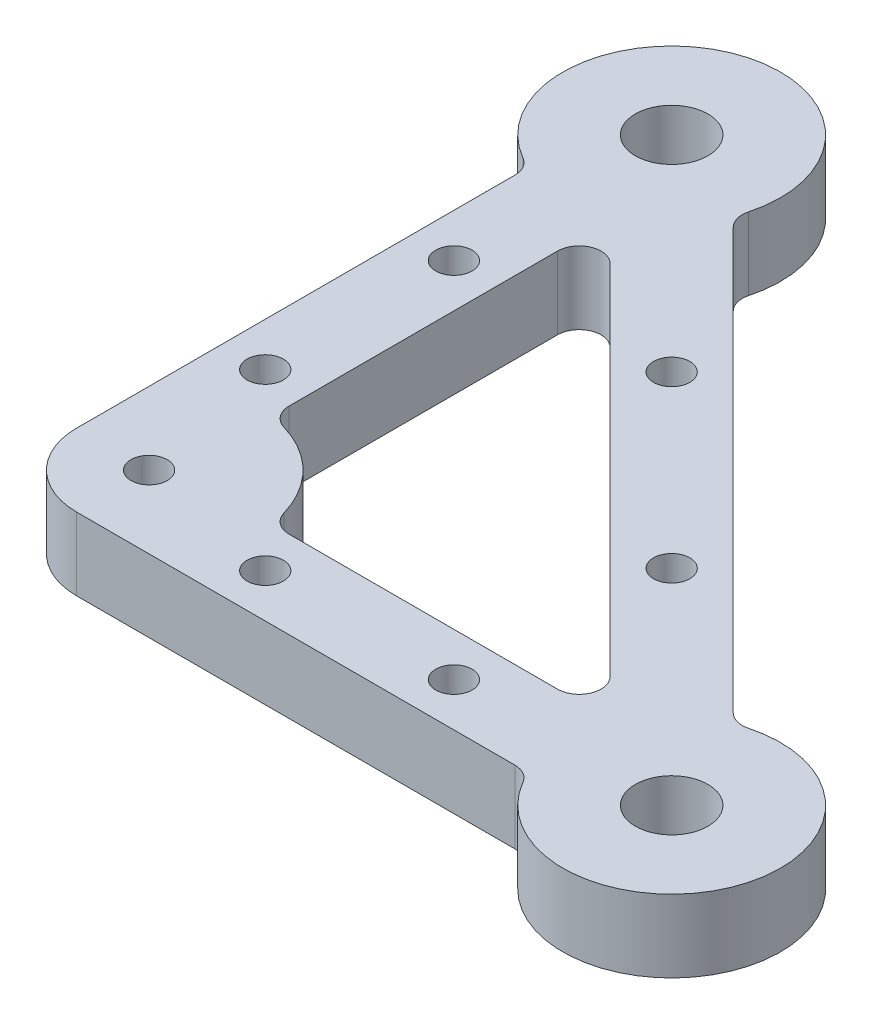
ISO-10303-21;
HEADER;
FILE_DESCRIPTION(('STEP AP214'),'2;1');
FILE_NAME('part.step','',(''),(''),'','','');
FILE_SCHEMA(('AUTOMOTIVE_DESIGN { 1 0 10303 214 1 1 1 1 }'));
ENDSEC;
DATA;
#1=APPLICATION_CONTEXT('core data for automotive mechanical design processes');
#2=APPLICATION_PROTOCOL_DEFINITION('international standard','automotive_design',2000,#1);
#3=PRODUCT_CONTEXT('',#1,'mechanical');
#4=PRODUCT('Part','Part','',(#3));
#5=PRODUCT_RELATED_PRODUCT_CATEGORY('part','',(#4));
#6=PRODUCT_DEFINITION_FORMATION('','',#4);
#7=PRODUCT_DEFINITION_CONTEXT('part definition',#1,'design');
#8=PRODUCT_DEFINITION('design','',#6,#7);
#9=PRODUCT_DEFINITION_SHAPE('','',#8);
#10=(LENGTH_UNIT() NAMED_UNIT(*) SI_UNIT(.MILLI.,.METRE.));
#11=(NAMED_UNIT(*) PLANE_ANGLE_UNIT() SI_UNIT($,.RADIAN.));
#12=(NAMED_UNIT(*) SI_UNIT($,.STERADIAN.) SOLID_ANGLE_UNIT());
#13=UNCERTAINTY_MEASURE_WITH_UNIT(LENGTH_MEASURE(1.E-05),#10,'distance_accuracy_value','');
#14=(GEOMETRIC_REPRESENTATION_CONTEXT(3) GLOBAL_UNCERTAINTY_ASSIGNED_CONTEXT((#13)) GLOBAL_UNIT_ASSIGNED_CONTEXT((#10,
#11,#12)) REPRESENTATION_CONTEXT('',''));
#15=CARTESIAN_POINT('',(0.,0.,0.));
#16=DIRECTION('',(0.,0.,1.));
#17=DIRECTION('',(1.,0.,0.));
#18=AXIS2_PLACEMENT_3D('',#15,#16,#17);
#19=CARTESIAN_POINT('',(0.,10.,0.));
#20=DIRECTION('',(0.,1.,0.));
#21=DIRECTION('',(0.,0.,1.));
#22=AXIS2_PLACEMENT_3D('',#19,#20,#21);
#23=PLANE('',#22);
#24=CARTESIAN_POINT('',(51.7157287525381,10.,51.7157287525381));
#25=DIRECTION('',(0.,1.,0.));
#26=DIRECTION('',(0.,0.,1.));
#27=AXIS2_PLACEMENT_3D('',#24,#25,#26);
#28=CIRCLE('',#27,2.5);
#29=CARTESIAN_POINT('',(51.7157287525381,10.,54.2157287525381));
#30=VERTEX_POINT('',#29);
#31=EDGE_CURVE('E364',#30,#30,#28,.T.);
#32=ORIENTED_EDGE('',*,*,#31,.F.);
#33=EDGE_LOOP('',(#32));
#34=FACE_BOUND('',#33,.T.);
#35=CARTESIAN_POINT('',(0.,10.,30.));
#36=DIRECTION('',(0.,1.,0.));
#37=DIRECTION('',(0.,0.,1.));
#38=AXIS2_PLACEMENT_3D('',#35,#36,#37);
#39=CIRCLE('',#38,2.5);
#40=CARTESIAN_POINT('',(0.,10.,32.5));
#41=VERTEX_POINT('',#40);
#42=EDGE_CURVE('E380',#41,#41,#39,.T.);
#43=ORIENTED_EDGE('',*,*,#42,.F.);
#44=EDGE_LOOP('',(#43));
#45=FACE_BOUND('',#44,.T.);
#46=CARTESIAN_POINT('',(24.,10.,80.));
#47=DIRECTION('',(0.,1.,0.));
#48=DIRECTION('',(0.,0.,1.));
#49=AXIS2_PLACEMENT_3D('',#46,#47,#48);
#50=CIRCLE('',#49,2.5);
#51=CARTESIAN_POINT('',(24.,10.,82.5));
#52=VERTEX_POINT('',#51);
#53=EDGE_CURVE('E396',#52,#52,#50,.T.);
#54=ORIENTED_EDGE('',*,*,#53,.F.);
#55=EDGE_LOOP('',(#54));
#56=FACE_BOUND('',#55,.T.);
#57=CARTESIAN_POINT('',(80.,10.,80.));
#58=DIRECTION('',(0.,1.,0.));
#59=DIRECTION('',(0.,0.,1.));
#60=AXIS2_PLACEMENT_3D('',#57,#58,#59);
#61=CIRCLE('',#60,5.00000000000001);
#62=CARTESIAN_POINT('',(80.,10.,85.));
#63=VERTEX_POINT('',#62);
#64=EDGE_CURVE('E412',#63,#63,#61,.T.);
#65=ORIENTED_EDGE('',*,*,#64,.F.);
#66=EDGE_LOOP('',(#65));
#67=FACE_BOUND('',#66,.T.);
#68=CARTESIAN_POINT('',(0.,10.,0.));
#69=DIRECTION('',(0.,1.,0.));
#70=DIRECTION('',(0.,0.,1.));
#71=AXIS2_PLACEMENT_3D('',#68,#69,#70);
#72=CIRCLE('',#71,15.);
#73=CARTESIAN_POINT('',(14.488887394336,10.,3.88228567653781));
#74=VERTEX_POINT('',#73);
#75=CARTESIAN_POINT('',(-7.5,10.,12.9903810567666));
#76=VERTEX_POINT('',#75);
#77=EDGE_CURVE('E187',#74,#76,#72,.T.);
#78=ORIENTED_EDGE('',*,*,#77,.T.);
#79=CARTESIAN_POINT('',(-9.,10.,15.5884572681199));
#80=DIRECTION('',(0.,1.,0.));
#81=DIRECTION('',(0.,0.,1.));
#82=AXIS2_PLACEMENT_3D('',#79,#80,#81);
#83=CIRCLE('',#82,3.);
#84=CARTESIAN_POINT('',(-6.,10.,15.5884572681199));
#85=VERTEX_POINT('',#84);
#86=EDGE_CURVE('E262',#76,#85,#83,.F.);
#87=ORIENTED_EDGE('',*,*,#86,.T.);
#88=DIRECTION('',(0.,0.,1.));
#89=VECTOR('',#88,1.);
#90=CARTESIAN_POINT('',(-6.,10.,86.));
#91=LINE('',#90,#89);
#92=CARTESIAN_POINT('',(-6.,10.,76.));
#93=VERTEX_POINT('',#92);
#94=EDGE_CURVE('E212',#85,#93,#91,.T.);
#95=ORIENTED_EDGE('',*,*,#94,.T.);
#96=CARTESIAN_POINT('',(4.,10.,76.));
#97=DIRECTION('',(0.,1.,0.));
#98=DIRECTION('',(0.,0.,1.));
#99=AXIS2_PLACEMENT_3D('',#96,#97,#98);
#100=CIRCLE('',#99,10.);
#101=CARTESIAN_POINT('',(4.,10.,86.));
#102=VERTEX_POINT('',#101);
#103=EDGE_CURVE('E216',#93,#102,#100,.T.);
#104=ORIENTED_EDGE('',*,*,#103,.T.);
#105=DIRECTION('',(1.,0.,0.));
#106=VECTOR('',#105,1.);
#107=CARTESIAN_POINT('',(66.2522729151325,10.,86.));
#108=LINE('',#107,#106);
#109=CARTESIAN_POINT('',(64.4115427318801,10.,86.));
#110=VERTEX_POINT('',#109);
#111=EDGE_CURVE('E185',#102,#110,#108,.T.);
#112=ORIENTED_EDGE('',*,*,#111,.T.);
#113=CARTESIAN_POINT('',(64.4115427318801,10.,89.));
#114=DIRECTION('',(0.,1.,0.));
#115=DIRECTION('',(0.,0.,1.));
#116=AXIS2_PLACEMENT_3D('',#113,#114,#115);
#117=CIRCLE('',#116,3.);
#118=CARTESIAN_POINT('',(67.0096189432334,10.,87.5));
#119=VERTEX_POINT('',#118);
#120=EDGE_CURVE('E267',#110,#119,#117,.F.);
#121=ORIENTED_EDGE('',*,*,#120,.T.);
#122=CARTESIAN_POINT('',(80.,10.,80.));
#123=DIRECTION('',(0.,1.,0.));
#124=DIRECTION('',(0.,0.,1.));
#125=AXIS2_PLACEMENT_3D('',#122,#123,#124);
#126=CIRCLE('',#125,15.);
#127=CARTESIAN_POINT('',(76.1177143234622,10.,65.511112605664));
#128=VERTEX_POINT('',#127);
#129=EDGE_CURVE('E430',#119,#128,#126,.T.);
#130=ORIENTED_EDGE('',*,*,#129,.T.);
#131=CARTESIAN_POINT('',(75.3412571881546,10.,62.6133351267968));
#132=DIRECTION('',(0.,1.,0.));
#133=DIRECTION('',(0.,0.,1.));
#134=AXIS2_PLACEMENT_3D('',#131,#132,#133);
#135=CIRCLE('',#134,3.);
#136=CARTESIAN_POINT('',(73.219936844595,10.,64.7346554703564));
#137=VERTEX_POINT('',#136);
#138=EDGE_CURVE('E250',#128,#137,#135,.F.);
#139=ORIENTED_EDGE('',*,*,#138,.T.);
#140=DIRECTION('',(-0.707106781186547,0.,-0.707106781186548));
#141=VECTOR('',#140,1.);
#142=CARTESIAN_POINT('',(13.9637517347311,10.,5.4784703604925));
#143=LINE('',#142,#141);
#144=CARTESIAN_POINT('',(15.2653445296436,10.,6.78006315540501));
#145=VERTEX_POINT('',#144);
#146=EDGE_CURVE('E434',#137,#145,#143,.T.);
#147=ORIENTED_EDGE('',*,*,#146,.T.);
#148=CARTESIAN_POINT('',(17.3866648732032,10.,4.65874281184537));
#149=DIRECTION('',(0.,1.,0.));
#150=DIRECTION('',(0.,0.,1.));
#151=AXIS2_PLACEMENT_3D('',#148,#149,#150);
#152=CIRCLE('',#151,3.);
#153=EDGE_CURVE('E256',#145,#74,#152,.F.);
#154=ORIENTED_EDGE('',*,*,#153,.T.);
#155=EDGE_LOOP('',(#78,#87,#95,#104,#112,#121,#130,#139,#147,#154));
#156=FACE_BOUND('',#155,.T.);
#157=CARTESIAN_POINT('',(0.,10.,0.));
#158=DIRECTION('',(0.,1.,0.));
#159=DIRECTION('',(0.,0.,1.));
#160=AXIS2_PLACEMENT_3D('',#157,#158,#159);
#161=CIRCLE('',#160,5.);
#162=CARTESIAN_POINT('',(0.,10.,5.));
#163=VERTEX_POINT('',#162);
#164=EDGE_CURVE('E202',#163,#163,#161,.T.);
#165=ORIENTED_EDGE('',*,*,#164,.F.);
#166=EDGE_LOOP('',(#165));
#167=FACE_BOUND('',#166,.T.);
#168=CARTESIAN_POINT('',(50.,10.,80.));
#169=DIRECTION('',(0.,1.,0.));
#170=DIRECTION('',(0.,0.,1.));
#171=AXIS2_PLACEMENT_3D('',#168,#169,#170);
#172=CIRCLE('',#171,2.5);
#173=CARTESIAN_POINT('',(50.,10.,82.5));
#174=VERTEX_POINT('',#173);
#175=EDGE_CURVE('E404',#174,#174,#172,.T.);
#176=ORIENTED_EDGE('',*,*,#175,.F.);
#177=EDGE_LOOP('',(#176));
#178=FACE_BOUND('',#177,.T.);
#179=CARTESIAN_POINT('',(0.,10.,56.));
#180=DIRECTION('',(0.,1.,0.));
#181=DIRECTION('',(0.,0.,1.));
#182=AXIS2_PLACEMENT_3D('',#179,#180,#181);
#183=CIRCLE('',#182,2.5);
#184=CARTESIAN_POINT('',(0.,10.,58.5));
#185=VERTEX_POINT('',#184);
#186=EDGE_CURVE('E388',#185,#185,#183,.T.);
#187=ORIENTED_EDGE('',*,*,#186,.F.);
#188=EDGE_LOOP('',(#187));
#189=FACE_BOUND('',#188,.T.);
#190=CARTESIAN_POINT('',(28.2842712474619,10.,28.2842712474619));
#191=DIRECTION('',(0.,1.,0.));
#192=DIRECTION('',(0.,0.,1.));
#193=AXIS2_PLACEMENT_3D('',#190,#191,#192);
#194=CIRCLE('',#193,2.5);
#195=CARTESIAN_POINT('',(28.2842712474619,10.,30.7842712474619));
#196=VERTEX_POINT('',#195);
#197=EDGE_CURVE('E372',#196,#196,#194,.T.);
#198=ORIENTED_EDGE('',*,*,#197,.F.);
#199=EDGE_LOOP('',(#198));
#200=FACE_BOUND('',#199,.T.);
#201=CARTESIAN_POINT('',(4.,10.,76.));
#202=DIRECTION('',(0.,1.,0.));
#203=DIRECTION('',(0.,0.,1.));
#204=AXIS2_PLACEMENT_3D('',#201,#202,#203);
#205=CIRCLE('',#204,2.5);
#206=CARTESIAN_POINT('',(4.,10.,78.5));
#207=VERTEX_POINT('',#206);
#208=EDGE_CURVE('E356',#207,#207,#205,.T.);
#209=ORIENTED_EDGE('',*,*,#208,.F.);
#210=EDGE_LOOP('',(#209));
#211=FACE_BOUND('',#210,.T.);
#212=DIRECTION('',(0.,0.,1.));
#213=VECTOR('',#212,1.);
#214=CARTESIAN_POINT('',(6.00000000000001,10.,61.1339312526815));
#215=LINE('',#214,#213);
#216=CARTESIAN_POINT('',(6.00000000000001,10.,21.7279220613579));
#217=VERTEX_POINT('',#216);
#218=CARTESIAN_POINT('',(6.00000000000001,10.,58.7083835342094));
#219=VERTEX_POINT('',#218);
#220=EDGE_CURVE('E332',#217,#219,#215,.T.);
#221=ORIENTED_EDGE('',*,*,#220,.F.);
#222=CARTESIAN_POINT('',(9.00000000000001,10.,21.7279220613579));
#223=DIRECTION('',(0.,1.,0.));
#224=DIRECTION('',(0.,0.,1.));
#225=AXIS2_PLACEMENT_3D('',#222,#223,#224);
#226=CIRCLE('',#225,3.);
#227=CARTESIAN_POINT('',(11.1213203435597,10.,19.6066017177982));
#228=VERTEX_POINT('',#227);
#229=EDGE_CURVE('E294',#217,#228,#226,.F.);
#230=ORIENTED_EDGE('',*,*,#229,.T.);
#231=DIRECTION('',(-0.707106781186548,0.,-0.707106781186547));
#232=VECTOR('',#231,1.);
#233=CARTESIAN_POINT('',(6.00000000000001,10.,14.4852813742386));
#234=LINE('',#233,#232);
#235=CARTESIAN_POINT('',(60.3933982822018,10.,68.8786796564403));
#236=VERTEX_POINT('',#235);
#237=EDGE_CURVE('E336',#236,#228,#234,.T.);
#238=ORIENTED_EDGE('',*,*,#237,.F.);
#239=CARTESIAN_POINT('',(58.2720779386421,10.,71.));
#240=DIRECTION('',(0.,1.,0.));
#241=DIRECTION('',(0.,0.,1.));
#242=AXIS2_PLACEMENT_3D('',#239,#240,#241);
#243=CIRCLE('',#242,3.);
#244=CARTESIAN_POINT('',(58.2720779386421,10.,74.));
#245=VERTEX_POINT('',#244);
#246=EDGE_CURVE('E287',#236,#245,#243,.F.);
#247=ORIENTED_EDGE('',*,*,#246,.T.);
#248=DIRECTION('',(1.,0.,0.));
#249=VECTOR('',#248,1.);
#250=CARTESIAN_POINT('',(65.5147186257614,10.,74.));
#251=LINE('',#250,#249);
#252=CARTESIAN_POINT('',(21.2916164657906,10.,74.));
#253=VERTEX_POINT('',#252);
#254=EDGE_CURVE('E340',#253,#245,#251,.T.);
#255=ORIENTED_EDGE('',*,*,#254,.F.);
#256=CARTESIAN_POINT('',(21.2916164657906,10.,71.));
#257=DIRECTION('',(0.,1.,0.));
#258=DIRECTION('',(0.,0.,1.));
#259=AXIS2_PLACEMENT_3D('',#256,#257,#258);
#260=CIRCLE('',#259,3.);
#261=CARTESIAN_POINT('',(18.4096803881588,10.,71.8333333333333));
#262=VERTEX_POINT('',#261);
#263=EDGE_CURVE('E313',#253,#262,#260,.F.);
#264=ORIENTED_EDGE('',*,*,#263,.T.);
#265=CARTESIAN_POINT('',(4.,10.,76.));
#266=DIRECTION('',(0.,-1.,0.));
#267=DIRECTION('',(0.,0.,1.));
#268=AXIS2_PLACEMENT_3D('',#265,#266,#267);
#269=CIRCLE('',#268,15.);
#270=CARTESIAN_POINT('',(8.16666666666667,10.,61.5903196118412));
#271=VERTEX_POINT('',#270);
#272=EDGE_CURVE('E335',#271,#262,#269,.T.);
#273=ORIENTED_EDGE('',*,*,#272,.F.);
#274=CARTESIAN_POINT('',(9.00000000000001,10.,58.7083835342094));
#275=DIRECTION('',(0.,1.,0.));
#276=DIRECTION('',(0.,0.,1.));
#277=AXIS2_PLACEMENT_3D('',#274,#275,#276);
#278=CIRCLE('',#277,3.);
#279=EDGE_CURVE('E11',#271,#219,#278,.F.);
#280=ORIENTED_EDGE('',*,*,#279,.T.);
#281=EDGE_LOOP('',(#221,#230,#238,#247,#255,#264,#273,#280));
#282=FACE_BOUND('',#281,.T.);
#283=ADVANCED_FACE('F39',(#34,#45,#56,#67,#156,#167,#178,#189,#200,#211,#282),#23,.T.);
#284=CARTESIAN_POINT('',(0.,0.,0.));
#285=DIRECTION('',(0.,1.,0.));
#286=DIRECTION('',(0.,0.,1.));
#287=AXIS2_PLACEMENT_3D('',#284,#285,#286);
#288=PLANE('',#287);
#289=CARTESIAN_POINT('',(4.,0.,76.));
#290=DIRECTION('',(0.,1.,0.));
#291=DIRECTION('',(0.,0.,1.));
#292=AXIS2_PLACEMENT_3D('',#289,#290,#291);
#293=CIRCLE('',#292,2.5);
#294=CARTESIAN_POINT('',(4.,0.,78.5));
#295=VERTEX_POINT('',#294);
#296=EDGE_CURVE('E347',#295,#295,#293,.T.);
#297=ORIENTED_EDGE('',*,*,#296,.T.);
#298=EDGE_LOOP('',(#297));
#299=FACE_BOUND('',#298,.T.);
#300=CARTESIAN_POINT('',(51.7157287525381,0.,51.7157287525381));
#301=DIRECTION('',(0.,1.,0.));
#302=DIRECTION('',(0.,0.,1.));
#303=AXIS2_PLACEMENT_3D('',#300,#301,#302);
#304=CIRCLE('',#303,2.5);
#305=CARTESIAN_POINT('',(51.7157287525381,0.,54.2157287525381));
#306=VERTEX_POINT('',#305);
#307=EDGE_CURVE('E360',#306,#306,#304,.T.);
#308=ORIENTED_EDGE('',*,*,#307,.T.);
#309=EDGE_LOOP('',(#308));
#310=FACE_BOUND('',#309,.T.);
#311=CARTESIAN_POINT('',(28.2842712474619,0.,28.2842712474619));
#312=DIRECTION('',(0.,1.,0.));
#313=DIRECTION('',(0.,0.,1.));
#314=AXIS2_PLACEMENT_3D('',#311,#312,#313);
#315=CIRCLE('',#314,2.5);
#316=CARTESIAN_POINT('',(28.2842712474619,0.,30.7842712474619));
#317=VERTEX_POINT('',#316);
#318=EDGE_CURVE('E368',#317,#317,#315,.T.);
#319=ORIENTED_EDGE('',*,*,#318,.T.);
#320=EDGE_LOOP('',(#319));
#321=FACE_BOUND('',#320,.T.);
#322=CARTESIAN_POINT('',(0.,0.,30.));
#323=DIRECTION('',(0.,1.,0.));
#324=DIRECTION('',(0.,0.,1.));
#325=AXIS2_PLACEMENT_3D('',#322,#323,#324);
#326=CIRCLE('',#325,2.5);
#327=CARTESIAN_POINT('',(0.,0.,32.5));
#328=VERTEX_POINT('',#327);
#329=EDGE_CURVE('E376',#328,#328,#326,.T.);
#330=ORIENTED_EDGE('',*,*,#329,.T.);
#331=EDGE_LOOP('',(#330));
#332=FACE_BOUND('',#331,.T.);
#333=CARTESIAN_POINT('',(0.,0.,56.));
#334=DIRECTION('',(0.,1.,0.));
#335=DIRECTION('',(0.,0.,1.));
#336=AXIS2_PLACEMENT_3D('',#333,#334,#335);
#337=CIRCLE('',#336,2.5);
#338=CARTESIAN_POINT('',(0.,0.,58.5));
#339=VERTEX_POINT('',#338);
#340=EDGE_CURVE('E384',#339,#339,#337,.T.);
#341=ORIENTED_EDGE('',*,*,#340,.T.);
#342=EDGE_LOOP('',(#341));
#343=FACE_BOUND('',#342,.T.);
#344=CARTESIAN_POINT('',(24.,0.,80.));
#345=DIRECTION('',(0.,1.,0.));
#346=DIRECTION('',(0.,0.,1.));
#347=AXIS2_PLACEMENT_3D('',#344,#345,#346);
#348=CIRCLE('',#347,2.5);
#349=CARTESIAN_POINT('',(24.,0.,82.5));
#350=VERTEX_POINT('',#349);
#351=EDGE_CURVE('E392',#350,#350,#348,.T.);
#352=ORIENTED_EDGE('',*,*,#351,.T.);
#353=EDGE_LOOP('',(#352));
#354=FACE_BOUND('',#353,.T.);
#355=CARTESIAN_POINT('',(50.,0.,80.));
#356=DIRECTION('',(0.,1.,0.));
#357=DIRECTION('',(0.,0.,1.));
#358=AXIS2_PLACEMENT_3D('',#355,#356,#357);
#359=CIRCLE('',#358,2.5);
#360=CARTESIAN_POINT('',(50.,0.,82.5));
#361=VERTEX_POINT('',#360);
#362=EDGE_CURVE('E400',#361,#361,#359,.T.);
#363=ORIENTED_EDGE('',*,*,#362,.T.);
#364=EDGE_LOOP('',(#363));
#365=FACE_BOUND('',#364,.T.);
#366=CARTESIAN_POINT('',(80.,0.,80.));
#367=DIRECTION('',(0.,1.,0.));
#368=DIRECTION('',(0.,0.,1.));
#369=AXIS2_PLACEMENT_3D('',#366,#367,#368);
#370=CIRCLE('',#369,5.00000000000001);
#371=CARTESIAN_POINT('',(80.,0.,85.));
#372=VERTEX_POINT('',#371);
#373=EDGE_CURVE('E408',#372,#372,#370,.T.);
#374=ORIENTED_EDGE('',*,*,#373,.T.);
#375=EDGE_LOOP('',(#374));
#376=FACE_BOUND('',#375,.T.);
#377=CARTESIAN_POINT('',(0.,0.,0.));
#378=DIRECTION('',(0.,1.,0.));
#379=DIRECTION('',(0.,0.,1.));
#380=AXIS2_PLACEMENT_3D('',#377,#378,#379);
#381=CIRCLE('',#380,5.);
#382=CARTESIAN_POINT('',(0.,0.,5.));
#383=VERTEX_POINT('',#382);
#384=EDGE_CURVE('E416',#383,#383,#381,.T.);
#385=ORIENTED_EDGE('',*,*,#384,.T.);
#386=EDGE_LOOP('',(#385));
#387=FACE_BOUND('',#386,.T.);
#388=DIRECTION('',(1.,0.,0.));
#389=VECTOR('',#388,1.);
#390=CARTESIAN_POINT('',(66.2522729151325,0.,86.));
#391=LINE('',#390,#389);
#392=CARTESIAN_POINT('',(4.,0.,86.));
#393=VERTEX_POINT('',#392);
#394=CARTESIAN_POINT('',(64.4115427318801,0.,86.));
#395=VERTEX_POINT('',#394);
#396=EDGE_CURVE('E182',#393,#395,#391,.T.);
#397=ORIENTED_EDGE('',*,*,#396,.F.);
#398=CARTESIAN_POINT('',(4.,0.,76.));
#399=DIRECTION('',(0.,1.,0.));
#400=DIRECTION('',(0.,0.,1.));
#401=AXIS2_PLACEMENT_3D('',#398,#399,#400);
#402=CIRCLE('',#401,10.);
#403=CARTESIAN_POINT('',(-6.,0.,76.));
#404=VERTEX_POINT('',#403);
#405=EDGE_CURVE('E166',#393,#404,#402,.F.);
#406=ORIENTED_EDGE('',*,*,#405,.T.);
#407=DIRECTION('',(0.,0.,1.));
#408=VECTOR('',#407,1.);
#409=CARTESIAN_POINT('',(-6.,0.,86.));
#410=LINE('',#409,#408);
#411=CARTESIAN_POINT('',(-6.,0.,15.5884572681199));
#412=VERTEX_POINT('',#411);
#413=EDGE_CURVE('E195',#412,#404,#410,.T.);
#414=ORIENTED_EDGE('',*,*,#413,.F.);
#415=CARTESIAN_POINT('',(-9.,0.,15.5884572681199));
#416=DIRECTION('',(0.,1.,0.));
#417=DIRECTION('',(0.,0.,1.));
#418=AXIS2_PLACEMENT_3D('',#415,#416,#417);
#419=CIRCLE('',#418,3.);
#420=CARTESIAN_POINT('',(-7.5,0.,12.9903810567666));
#421=VERTEX_POINT('',#420);
#422=EDGE_CURVE('E259',#412,#421,#419,.T.);
#423=ORIENTED_EDGE('',*,*,#422,.T.);
#424=CARTESIAN_POINT('',(0.,0.,0.));
#425=DIRECTION('',(0.,1.,0.));
#426=DIRECTION('',(0.,0.,1.));
#427=AXIS2_PLACEMENT_3D('',#424,#425,#426);
#428=CIRCLE('',#427,15.);
#429=CARTESIAN_POINT('',(14.488887394336,0.,3.88228567653781));
#430=VERTEX_POINT('',#429);
#431=EDGE_CURVE('E209',#430,#421,#428,.T.);
#432=ORIENTED_EDGE('',*,*,#431,.F.);
#433=CARTESIAN_POINT('',(17.3866648732032,0.,4.65874281184537));
#434=DIRECTION('',(0.,1.,0.));
#435=DIRECTION('',(0.,0.,1.));
#436=AXIS2_PLACEMENT_3D('',#433,#434,#435);
#437=CIRCLE('',#436,3.);
#438=CARTESIAN_POINT('',(15.2653445296436,0.,6.78006315540501));
#439=VERTEX_POINT('',#438);
#440=EDGE_CURVE('E253',#430,#439,#437,.T.);
#441=ORIENTED_EDGE('',*,*,#440,.T.);
#442=DIRECTION('',(-0.707106781186547,0.,-0.707106781186548));
#443=VECTOR('',#442,1.);
#444=CARTESIAN_POINT('',(13.9637517347311,0.,5.4784703604925));
#445=LINE('',#444,#443);
#446=CARTESIAN_POINT('',(73.219936844595,0.,64.7346554703564));
#447=VERTEX_POINT('',#446);
#448=EDGE_CURVE('E200',#447,#439,#445,.T.);
#449=ORIENTED_EDGE('',*,*,#448,.F.);
#450=CARTESIAN_POINT('',(75.3412571881546,0.,62.6133351267968));
#451=DIRECTION('',(0.,1.,0.));
#452=DIRECTION('',(0.,0.,1.));
#453=AXIS2_PLACEMENT_3D('',#450,#451,#452);
#454=CIRCLE('',#453,3.);
#455=CARTESIAN_POINT('',(76.1177143234622,0.,65.511112605664));
#456=VERTEX_POINT('',#455);
#457=EDGE_CURVE('E247',#447,#456,#454,.T.);
#458=ORIENTED_EDGE('',*,*,#457,.T.);
#459=CARTESIAN_POINT('',(80.,0.,80.));
#460=DIRECTION('',(0.,1.,0.));
#461=DIRECTION('',(0.,0.,1.));
#462=AXIS2_PLACEMENT_3D('',#459,#460,#461);
#463=CIRCLE('',#462,15.);
#464=CARTESIAN_POINT('',(67.0096189432334,0.,87.5));
#465=VERTEX_POINT('',#464);
#466=EDGE_CURVE('E194',#465,#456,#463,.T.);
#467=ORIENTED_EDGE('',*,*,#466,.F.);
#468=CARTESIAN_POINT('',(64.4115427318801,0.,89.));
#469=DIRECTION('',(0.,1.,0.));
#470=DIRECTION('',(0.,0.,1.));
#471=AXIS2_PLACEMENT_3D('',#468,#469,#470);
#472=CIRCLE('',#471,3.);
#473=EDGE_CURVE('E192',#465,#395,#472,.T.);
#474=ORIENTED_EDGE('',*,*,#473,.T.);
#475=EDGE_LOOP('',(#397,#406,#414,#423,#432,#441,#449,#458,#467,#474));
#476=FACE_BOUND('',#475,.T.);
#477=CARTESIAN_POINT('',(4.,0.,76.));
#478=DIRECTION('',(0.,-1.,0.));
#479=DIRECTION('',(0.,0.,1.));
#480=AXIS2_PLACEMENT_3D('',#477,#478,#479);
#481=CIRCLE('',#480,15.);
#482=CARTESIAN_POINT('',(8.16666666666667,0.,61.5903196118412));
#483=VERTEX_POINT('',#482);
#484=CARTESIAN_POINT('',(18.4096803881588,0.,71.8333333333333));
#485=VERTEX_POINT('',#484);
#486=EDGE_CURVE('E319',#483,#485,#481,.T.);
#487=ORIENTED_EDGE('',*,*,#486,.T.);
#488=CARTESIAN_POINT('',(21.2916164657906,0.,71.));
#489=DIRECTION('',(0.,1.,0.));
#490=DIRECTION('',(0.,0.,1.));
#491=AXIS2_PLACEMENT_3D('',#488,#489,#490);
#492=CIRCLE('',#491,3.);
#493=CARTESIAN_POINT('',(21.2916164657906,0.,74.));
#494=VERTEX_POINT('',#493);
#495=EDGE_CURVE('E310',#485,#494,#492,.T.);
#496=ORIENTED_EDGE('',*,*,#495,.T.);
#497=DIRECTION('',(1.,0.,0.));
#498=VECTOR('',#497,1.);
#499=CARTESIAN_POINT('',(65.5147186257614,0.,74.));
#500=LINE('',#499,#498);
#501=CARTESIAN_POINT('',(58.2720779386421,0.,74.));
#502=VERTEX_POINT('',#501);
#503=EDGE_CURVE('E327',#494,#502,#500,.T.);
#504=ORIENTED_EDGE('',*,*,#503,.T.);
#505=CARTESIAN_POINT('',(58.2720779386421,0.,71.));
#506=DIRECTION('',(0.,1.,0.));
#507=DIRECTION('',(0.,0.,1.));
#508=AXIS2_PLACEMENT_3D('',#505,#506,#507);
#509=CIRCLE('',#508,3.);
#510=CARTESIAN_POINT('',(60.3933982822018,0.,68.8786796564403));
#511=VERTEX_POINT('',#510);
#512=EDGE_CURVE('E284',#502,#511,#509,.T.);
#513=ORIENTED_EDGE('',*,*,#512,.T.);
#514=DIRECTION('',(-0.707106781186548,0.,-0.707106781186547));
#515=VECTOR('',#514,1.);
#516=CARTESIAN_POINT('',(6.00000000000001,0.,14.4852813742386));
#517=LINE('',#516,#515);
#518=CARTESIAN_POINT('',(11.1213203435597,0.,19.6066017177982));
#519=VERTEX_POINT('',#518);
#520=EDGE_CURVE('E348',#511,#519,#517,.T.);
#521=ORIENTED_EDGE('',*,*,#520,.T.);
#522=CARTESIAN_POINT('',(9.00000000000001,0.,21.7279220613579));
#523=DIRECTION('',(0.,1.,0.));
#524=DIRECTION('',(0.,0.,1.));
#525=AXIS2_PLACEMENT_3D('',#522,#523,#524);
#526=CIRCLE('',#525,3.);
#527=CARTESIAN_POINT('',(6.00000000000001,0.,21.7279220613579));
#528=VERTEX_POINT('',#527);
#529=EDGE_CURVE('E291',#519,#528,#526,.T.);
#530=ORIENTED_EDGE('',*,*,#529,.T.);
#531=DIRECTION('',(0.,0.,1.));
#532=VECTOR('',#531,1.);
#533=CARTESIAN_POINT('',(6.00000000000001,0.,61.1339312526815));
#534=LINE('',#533,#532);
#535=CARTESIAN_POINT('',(6.00000000000001,0.,58.7083835342094));
#536=VERTEX_POINT('',#535);
#537=EDGE_CURVE('E321',#528,#536,#534,.T.);
#538=ORIENTED_EDGE('',*,*,#537,.T.);
#539=CARTESIAN_POINT('',(9.00000000000001,0.,58.7083835342094));
#540=DIRECTION('',(0.,1.,0.));
#541=DIRECTION('',(0.,0.,1.));
#542=AXIS2_PLACEMENT_3D('',#539,#540,#541);
#543=CIRCLE('',#542,3.);
#544=EDGE_CURVE('E48',#536,#483,#543,.T.);
#545=ORIENTED_EDGE('',*,*,#544,.T.);
#546=EDGE_LOOP('',(#487,#496,#504,#513,#521,#530,#538,#545));
#547=FACE_BOUND('',#546,.T.);
#548=ADVANCED_FACE('F189',(#299,#310,#321,#332,#343,#354,#365,#376,#387,#476,#547),#288,.F.);
#549=CARTESIAN_POINT('',(-6.,10.,86.));
#550=DIRECTION('',(1.,0.,0.));
#551=DIRECTION('',(0.,0.,-1.));
#552=AXIS2_PLACEMENT_3D('',#549,#550,#551);
#553=PLANE('',#552);
#554=ORIENTED_EDGE('',*,*,#94,.F.);
#555=DIRECTION('',(0.,1.,0.));
#556=VECTOR('',#555,1.);
#557=CARTESIAN_POINT('',(-6.,0.,15.5884572681199));
#558=LINE('',#557,#556);
#559=EDGE_CURVE('E240',#85,#412,#558,.F.);
#560=ORIENTED_EDGE('',*,*,#559,.T.);
#561=ORIENTED_EDGE('',*,*,#413,.T.);
#562=DIRECTION('',(0.,-1.,0.));
#563=VECTOR('',#562,1.);
#564=CARTESIAN_POINT('',(-6.,10.,76.));
#565=LINE('',#564,#563);
#566=EDGE_CURVE('E172',#404,#93,#565,.F.);
#567=ORIENTED_EDGE('',*,*,#566,.T.);
#568=EDGE_LOOP('',(#554,#560,#561,#567));
#569=FACE_BOUND('',#568,.T.);
#570=ADVANCED_FACE('F452',(#569),#553,.F.);
#571=CARTESIAN_POINT('',(66.2522729151325,10.,86.));
#572=DIRECTION('',(0.,0.,-1.));
#573=DIRECTION('',(-1.,0.,0.));
#574=AXIS2_PLACEMENT_3D('',#571,#572,#573);
#575=PLANE('',#574);
#576=ORIENTED_EDGE('',*,*,#396,.T.);
#577=DIRECTION('',(0.,1.,0.));
#578=VECTOR('',#577,1.);
#579=CARTESIAN_POINT('',(64.4115427318801,10.,86.));
#580=LINE('',#579,#578);
#581=EDGE_CURVE('E244',#395,#110,#580,.T.);
#582=ORIENTED_EDGE('',*,*,#581,.T.);
#583=ORIENTED_EDGE('',*,*,#111,.F.);
#584=DIRECTION('',(0.,-1.,0.));
#585=VECTOR('',#584,1.);
#586=CARTESIAN_POINT('',(4.,10.,86.));
#587=LINE('',#586,#585);
#588=EDGE_CURVE('E170',#102,#393,#587,.T.);
#589=ORIENTED_EDGE('',*,*,#588,.T.);
#590=EDGE_LOOP('',(#576,#582,#583,#589));
#591=FACE_BOUND('',#590,.T.);
#592=ADVANCED_FACE('F181',(#591),#575,.F.);
#593=CARTESIAN_POINT('',(80.,10.,80.));
#594=DIRECTION('',(0.,-1.,0.));
#595=DIRECTION('',(0.,0.,-1.));
#596=AXIS2_PLACEMENT_3D('',#593,#594,#595);
#597=CYLINDRICAL_SURFACE('',#596,15.);
#598=ORIENTED_EDGE('',*,*,#466,.T.);
#599=DIRECTION('',(0.,-1.,0.));
#600=VECTOR('',#599,1.);
#601=CARTESIAN_POINT('',(76.1177143234622,10.,65.511112605664));
#602=LINE('',#601,#600);
#603=EDGE_CURVE('E230',#456,#128,#602,.F.);
#604=ORIENTED_EDGE('',*,*,#603,.T.);
#605=ORIENTED_EDGE('',*,*,#129,.F.);
#606=DIRECTION('',(0.,-1.,0.));
#607=VECTOR('',#606,1.);
#608=CARTESIAN_POINT('',(67.0096189432334,10.,87.5));
#609=LINE('',#608,#607);
#610=EDGE_CURVE('E226',#119,#465,#609,.T.);
#611=ORIENTED_EDGE('',*,*,#610,.T.);
#612=EDGE_LOOP('',(#598,#604,#605,#611));
#613=FACE_BOUND('',#612,.T.);
#614=ADVANCED_FACE('F468',(#613),#597,.T.);
#615=CARTESIAN_POINT('',(13.9637517347311,10.,5.4784703604925));
#616=DIRECTION('',(-0.707106781186548,0.,0.707106781186547));
#617=DIRECTION('',(0.707106781186547,0.,0.707106781186548));
#618=AXIS2_PLACEMENT_3D('',#615,#616,#617);
#619=PLANE('',#618);
#620=ORIENTED_EDGE('',*,*,#146,.F.);
#621=DIRECTION('',(0.,1.,0.));
#622=VECTOR('',#621,1.);
#623=CARTESIAN_POINT('',(73.219936844595,0.,64.7346554703564));
#624=LINE('',#623,#622);
#625=EDGE_CURVE('E222',#137,#447,#624,.F.);
#626=ORIENTED_EDGE('',*,*,#625,.T.);
#627=ORIENTED_EDGE('',*,*,#448,.T.);
#628=DIRECTION('',(0.,1.,0.));
#629=VECTOR('',#628,1.);
#630=CARTESIAN_POINT('',(15.2653445296436,10.,6.78006315540501));
#631=LINE('',#630,#629);
#632=EDGE_CURVE('E219',#439,#145,#631,.T.);
#633=ORIENTED_EDGE('',*,*,#632,.T.);
#634=EDGE_LOOP('',(#620,#626,#627,#633));
#635=FACE_BOUND('',#634,.T.);
#636=ADVANCED_FACE('F461',(#635),#619,.F.);
#637=CARTESIAN_POINT('',(0.,10.,0.));
#638=DIRECTION('',(0.,-1.,0.));
#639=DIRECTION('',(0.,0.,-1.));
#640=AXIS2_PLACEMENT_3D('',#637,#638,#639);
#641=CYLINDRICAL_SURFACE('',#640,15.);
#642=ORIENTED_EDGE('',*,*,#77,.F.);
#643=DIRECTION('',(0.,-1.,0.));
#644=VECTOR('',#643,1.);
#645=CARTESIAN_POINT('',(14.488887394336,10.,3.88228567653781));
#646=LINE('',#645,#644);
#647=EDGE_CURVE('E236',#74,#430,#646,.T.);
#648=ORIENTED_EDGE('',*,*,#647,.T.);
#649=ORIENTED_EDGE('',*,*,#431,.T.);
#650=DIRECTION('',(0.,-1.,0.));
#651=VECTOR('',#650,1.);
#652=CARTESIAN_POINT('',(-7.5,10.,12.9903810567666));
#653=LINE('',#652,#651);
#654=EDGE_CURVE('E233',#421,#76,#653,.F.);
#655=ORIENTED_EDGE('',*,*,#654,.T.);
#656=EDGE_LOOP('',(#642,#648,#649,#655));
#657=FACE_BOUND('',#656,.T.);
#658=ADVANCED_FACE('F454',(#657),#641,.T.);
#659=CARTESIAN_POINT('',(0.,10.,0.));
#660=DIRECTION('',(0.,-1.,0.));
#661=DIRECTION('',(0.,0.,-1.));
#662=AXIS2_PLACEMENT_3D('',#659,#660,#661);
#663=CYLINDRICAL_SURFACE('',#662,5.);
#664=ORIENTED_EDGE('',*,*,#164,.T.);
#665=EDGE_LOOP('',(#664));
#666=FACE_BOUND('',#665,.T.);
#667=ORIENTED_EDGE('',*,*,#384,.F.);
#668=EDGE_LOOP('',(#667));
#669=FACE_BOUND('',#668,.T.);
#670=ADVANCED_FACE('F496',(#666,#669),#663,.F.);
#671=CARTESIAN_POINT('',(80.,10.,80.));
#672=DIRECTION('',(0.,-1.,0.));
#673=DIRECTION('',(0.,0.,-1.));
#674=AXIS2_PLACEMENT_3D('',#671,#672,#673);
#675=CYLINDRICAL_SURFACE('',#674,5.00000000000001);
#676=ORIENTED_EDGE('',*,*,#64,.T.);
#677=EDGE_LOOP('',(#676));
#678=FACE_BOUND('',#677,.T.);
#679=ORIENTED_EDGE('',*,*,#373,.F.);
#680=EDGE_LOOP('',(#679));
#681=FACE_BOUND('',#680,.T.);
#682=ADVANCED_FACE('F671',(#678,#681),#675,.F.);
#683=CARTESIAN_POINT('',(50.,10.,80.));
#684=DIRECTION('',(0.,-1.,0.));
#685=DIRECTION('',(0.,0.,-1.));
#686=AXIS2_PLACEMENT_3D('',#683,#684,#685);
#687=CYLINDRICAL_SURFACE('',#686,2.5);
#688=ORIENTED_EDGE('',*,*,#175,.T.);
#689=EDGE_LOOP('',(#688));
#690=FACE_BOUND('',#689,.T.);
#691=ORIENTED_EDGE('',*,*,#362,.F.);
#692=EDGE_LOOP('',(#691));
#693=FACE_BOUND('',#692,.T.);
#694=ADVANCED_FACE('F677',(#690,#693),#687,.F.);
#695=CARTESIAN_POINT('',(24.,10.,80.));
#696=DIRECTION('',(0.,-1.,0.));
#697=DIRECTION('',(0.,0.,-1.));
#698=AXIS2_PLACEMENT_3D('',#695,#696,#697);
#699=CYLINDRICAL_SURFACE('',#698,2.5);
#700=ORIENTED_EDGE('',*,*,#53,.T.);
#701=EDGE_LOOP('',(#700));
#702=FACE_BOUND('',#701,.T.);
#703=ORIENTED_EDGE('',*,*,#351,.F.);
#704=EDGE_LOOP('',(#703));
#705=FACE_BOUND('',#704,.T.);
#706=ADVANCED_FACE('F684',(#702,#705),#699,.F.);
#707=CARTESIAN_POINT('',(0.,10.,56.));
#708=DIRECTION('',(0.,-1.,0.));
#709=DIRECTION('',(0.,0.,-1.));
#710=AXIS2_PLACEMENT_3D('',#707,#708,#709);
#711=CYLINDRICAL_SURFACE('',#710,2.5);
#712=ORIENTED_EDGE('',*,*,#186,.T.);
#713=EDGE_LOOP('',(#712));
#714=FACE_BOUND('',#713,.T.);
#715=ORIENTED_EDGE('',*,*,#340,.F.);
#716=EDGE_LOOP('',(#715));
#717=FACE_BOUND('',#716,.T.);
#718=ADVANCED_FACE('F692',(#714,#717),#711,.F.);
#719=CARTESIAN_POINT('',(0.,10.,30.));
#720=DIRECTION('',(0.,-1.,0.));
#721=DIRECTION('',(0.,0.,-1.));
#722=AXIS2_PLACEMENT_3D('',#719,#720,#721);
#723=CYLINDRICAL_SURFACE('',#722,2.5);
#724=ORIENTED_EDGE('',*,*,#42,.T.);
#725=EDGE_LOOP('',(#724));
#726=FACE_BOUND('',#725,.T.);
#727=ORIENTED_EDGE('',*,*,#329,.F.);
#728=EDGE_LOOP('',(#727));
#729=FACE_BOUND('',#728,.T.);
#730=ADVANCED_FACE('F700',(#726,#729),#723,.F.);
#731=CARTESIAN_POINT('',(28.2842712474619,10.,28.2842712474619));
#732=DIRECTION('',(0.,-1.,0.));
#733=DIRECTION('',(0.,0.,-1.));
#734=AXIS2_PLACEMENT_3D('',#731,#732,#733);
#735=CYLINDRICAL_SURFACE('',#734,2.5);
#736=ORIENTED_EDGE('',*,*,#197,.T.);
#737=EDGE_LOOP('',(#736));
#738=FACE_BOUND('',#737,.T.);
#739=ORIENTED_EDGE('',*,*,#318,.F.);
#740=EDGE_LOOP('',(#739));
#741=FACE_BOUND('',#740,.T.);
#742=ADVANCED_FACE('F708',(#738,#741),#735,.F.);
#743=CARTESIAN_POINT('',(51.7157287525381,10.,51.7157287525381));
#744=DIRECTION('',(0.,-1.,0.));
#745=DIRECTION('',(0.,0.,-1.));
#746=AXIS2_PLACEMENT_3D('',#743,#744,#745);
#747=CYLINDRICAL_SURFACE('',#746,2.5);
#748=ORIENTED_EDGE('',*,*,#31,.T.);
#749=EDGE_LOOP('',(#748));
#750=FACE_BOUND('',#749,.T.);
#751=ORIENTED_EDGE('',*,*,#307,.F.);
#752=EDGE_LOOP('',(#751));
#753=FACE_BOUND('',#752,.T.);
#754=ADVANCED_FACE('F716',(#750,#753),#747,.F.);
#755=CARTESIAN_POINT('',(4.,10.,76.));
#756=DIRECTION('',(0.,-1.,0.));
#757=DIRECTION('',(0.,0.,-1.));
#758=AXIS2_PLACEMENT_3D('',#755,#756,#757);
#759=CYLINDRICAL_SURFACE('',#758,2.5);
#760=ORIENTED_EDGE('',*,*,#208,.T.);
#761=EDGE_LOOP('',(#760));
#762=FACE_BOUND('',#761,.T.);
#763=ORIENTED_EDGE('',*,*,#296,.F.);
#764=EDGE_LOOP('',(#763));
#765=FACE_BOUND('',#764,.T.);
#766=ADVANCED_FACE('F538',(#762,#765),#759,.F.);
#767=CARTESIAN_POINT('',(6.00000000000001,10.,14.4852813742386));
#768=DIRECTION('',(-0.707106781186547,0.,0.707106781186548));
#769=DIRECTION('',(0.707106781186548,0.,0.707106781186547));
#770=AXIS2_PLACEMENT_3D('',#767,#768,#769);
#771=PLANE('',#770);
#772=ORIENTED_EDGE('',*,*,#520,.F.);
#773=DIRECTION('',(0.,-1.,0.));
#774=VECTOR('',#773,1.);
#775=CARTESIAN_POINT('',(60.3933982822018,10.,68.8786796564403));
#776=LINE('',#775,#774);
#777=EDGE_CURVE('E278',#511,#236,#776,.F.);
#778=ORIENTED_EDGE('',*,*,#777,.T.);
#779=ORIENTED_EDGE('',*,*,#237,.T.);
#780=DIRECTION('',(0.,-1.,0.));
#781=VECTOR('',#780,1.);
#782=CARTESIAN_POINT('',(11.1213203435597,0.,19.6066017177982));
#783=LINE('',#782,#781);
#784=EDGE_CURVE('E274',#228,#519,#783,.T.);
#785=ORIENTED_EDGE('',*,*,#784,.T.);
#786=EDGE_LOOP('',(#772,#778,#779,#785));
#787=FACE_BOUND('',#786,.T.);
#788=ADVANCED_FACE('F533',(#787),#771,.T.);
#789=CARTESIAN_POINT('',(6.00000000000001,10.,61.1339312526815));
#790=DIRECTION('',(1.,0.,0.));
#791=DIRECTION('',(0.,0.,-1.));
#792=AXIS2_PLACEMENT_3D('',#789,#790,#791);
#793=PLANE('',#792);
#794=ORIENTED_EDGE('',*,*,#220,.T.);
#795=DIRECTION('',(0.,1.,0.));
#796=VECTOR('',#795,1.);
#797=CARTESIAN_POINT('',(6.00000000000001,0.,58.7083835342094));
#798=LINE('',#797,#796);
#799=EDGE_CURVE('E307',#219,#536,#798,.F.);
#800=ORIENTED_EDGE('',*,*,#799,.T.);
#801=ORIENTED_EDGE('',*,*,#537,.F.);
#802=DIRECTION('',(0.,-1.,0.));
#803=VECTOR('',#802,1.);
#804=CARTESIAN_POINT('',(6.00000000000001,10.,21.7279220613579));
#805=LINE('',#804,#803);
#806=EDGE_CURVE('E281',#528,#217,#805,.F.);
#807=ORIENTED_EDGE('',*,*,#806,.T.);
#808=EDGE_LOOP('',(#794,#800,#801,#807));
#809=FACE_BOUND('',#808,.T.);
#810=ADVANCED_FACE('F330',(#809),#793,.T.);
#811=CARTESIAN_POINT('',(4.,10.,76.));
#812=DIRECTION('',(0.,-1.,0.));
#813=DIRECTION('',(0.,0.,-1.));
#814=AXIS2_PLACEMENT_3D('',#811,#812,#813);
#815=CYLINDRICAL_SURFACE('',#814,15.);
#816=ORIENTED_EDGE('',*,*,#272,.T.);
#817=DIRECTION('',(0.,-1.,0.));
#818=VECTOR('',#817,1.);
#819=CARTESIAN_POINT('',(18.4096803881588,10.,71.8333333333333));
#820=LINE('',#819,#818);
#821=EDGE_CURVE('E300',#262,#485,#820,.T.);
#822=ORIENTED_EDGE('',*,*,#821,.T.);
#823=ORIENTED_EDGE('',*,*,#486,.F.);
#824=DIRECTION('',(0.,-1.,0.));
#825=VECTOR('',#824,1.);
#826=CARTESIAN_POINT('',(8.16666666666667,10.,61.5903196118412));
#827=LINE('',#826,#825);
#828=EDGE_CURVE('E297',#483,#271,#827,.F.);
#829=ORIENTED_EDGE('',*,*,#828,.T.);
#830=EDGE_LOOP('',(#816,#822,#823,#829));
#831=FACE_BOUND('',#830,.T.);
#832=ADVANCED_FACE('F324',(#831),#815,.T.);
#833=CARTESIAN_POINT('',(65.5147186257614,10.,74.));
#834=DIRECTION('',(0.,0.,-1.));
#835=DIRECTION('',(-1.,0.,0.));
#836=AXIS2_PLACEMENT_3D('',#833,#834,#835);
#837=PLANE('',#836);
#838=ORIENTED_EDGE('',*,*,#503,.F.);
#839=DIRECTION('',(0.,1.,0.));
#840=VECTOR('',#839,1.);
#841=CARTESIAN_POINT('',(21.2916164657906,10.,74.));
#842=LINE('',#841,#840);
#843=EDGE_CURVE('E304',#494,#253,#842,.T.);
#844=ORIENTED_EDGE('',*,*,#843,.T.);
#845=ORIENTED_EDGE('',*,*,#254,.T.);
#846=DIRECTION('',(0.,-1.,0.));
#847=VECTOR('',#846,1.);
#848=CARTESIAN_POINT('',(58.2720779386421,0.,74.));
#849=LINE('',#848,#847);
#850=EDGE_CURVE('E270',#245,#502,#849,.T.);
#851=ORIENTED_EDGE('',*,*,#850,.T.);
#852=EDGE_LOOP('',(#838,#844,#845,#851));
#853=FACE_BOUND('',#852,.T.);
#854=ADVANCED_FACE('F511',(#853),#837,.T.);
#855=CARTESIAN_POINT('',(4.,10.,76.));
#856=DIRECTION('',(0.,-1.,0.));
#857=DIRECTION('',(0.,0.,-1.));
#858=AXIS2_PLACEMENT_3D('',#855,#856,#857);
#859=CYLINDRICAL_SURFACE('',#858,10.);
#860=ORIENTED_EDGE('',*,*,#103,.F.);
#861=ORIENTED_EDGE('',*,*,#566,.F.);
#862=ORIENTED_EDGE('',*,*,#405,.F.);
#863=ORIENTED_EDGE('',*,*,#588,.F.);
#864=EDGE_LOOP('',(#860,#861,#862,#863));
#865=FACE_BOUND('',#864,.T.);
#866=ADVANCED_FACE('F169',(#865),#859,.T.);
#867=CARTESIAN_POINT('',(75.3412571881546,10.,62.6133351267968));
#868=DIRECTION('',(0.,-1.,0.));
#869=DIRECTION('',(0.,0.,-1.));
#870=AXIS2_PLACEMENT_3D('',#867,#868,#869);
#871=CYLINDRICAL_SURFACE('',#870,3.);
#872=ORIENTED_EDGE('',*,*,#138,.F.);
#873=ORIENTED_EDGE('',*,*,#603,.F.);
#874=ORIENTED_EDGE('',*,*,#457,.F.);
#875=ORIENTED_EDGE('',*,*,#625,.F.);
#876=EDGE_LOOP('',(#872,#873,#874,#875));
#877=FACE_BOUND('',#876,.T.);
#878=ADVANCED_FACE('F465',(#877),#871,.F.);
#879=CARTESIAN_POINT('',(17.3866648732032,10.,4.65874281184537));
#880=DIRECTION('',(0.,-1.,0.));
#881=DIRECTION('',(0.,0.,-1.));
#882=AXIS2_PLACEMENT_3D('',#879,#880,#881);
#883=CYLINDRICAL_SURFACE('',#882,3.);
#884=ORIENTED_EDGE('',*,*,#153,.F.);
#885=ORIENTED_EDGE('',*,*,#632,.F.);
#886=ORIENTED_EDGE('',*,*,#440,.F.);
#887=ORIENTED_EDGE('',*,*,#647,.F.);
#888=EDGE_LOOP('',(#884,#885,#886,#887));
#889=FACE_BOUND('',#888,.T.);
#890=ADVANCED_FACE('F456',(#889),#883,.F.);
#891=CARTESIAN_POINT('',(-9.,10.,15.5884572681199));
#892=DIRECTION('',(0.,-1.,0.));
#893=DIRECTION('',(0.,0.,-1.));
#894=AXIS2_PLACEMENT_3D('',#891,#892,#893);
#895=CYLINDRICAL_SURFACE('',#894,3.);
#896=ORIENTED_EDGE('',*,*,#86,.F.);
#897=ORIENTED_EDGE('',*,*,#654,.F.);
#898=ORIENTED_EDGE('',*,*,#422,.F.);
#899=ORIENTED_EDGE('',*,*,#559,.F.);
#900=EDGE_LOOP('',(#896,#897,#898,#899));
#901=FACE_BOUND('',#900,.T.);
#902=ADVANCED_FACE('F450',(#901),#895,.F.);
#903=CARTESIAN_POINT('',(64.4115427318801,10.,89.));
#904=DIRECTION('',(0.,-1.,0.));
#905=DIRECTION('',(0.,0.,-1.));
#906=AXIS2_PLACEMENT_3D('',#903,#904,#905);
#907=CYLINDRICAL_SURFACE('',#906,3.);
#908=ORIENTED_EDGE('',*,*,#120,.F.);
#909=ORIENTED_EDGE('',*,*,#581,.F.);
#910=ORIENTED_EDGE('',*,*,#473,.F.);
#911=ORIENTED_EDGE('',*,*,#610,.F.);
#912=EDGE_LOOP('',(#908,#909,#910,#911));
#913=FACE_BOUND('',#912,.T.);
#914=ADVANCED_FACE('F473',(#913),#907,.F.);
#915=CARTESIAN_POINT('',(58.2720779386421,10.,71.));
#916=DIRECTION('',(0.,1.,0.));
#917=DIRECTION('',(0.,0.,1.));
#918=AXIS2_PLACEMENT_3D('',#915,#916,#917);
#919=CYLINDRICAL_SURFACE('',#918,3.);
#920=ORIENTED_EDGE('',*,*,#246,.F.);
#921=ORIENTED_EDGE('',*,*,#777,.F.);
#922=ORIENTED_EDGE('',*,*,#512,.F.);
#923=ORIENTED_EDGE('',*,*,#850,.F.);
#924=EDGE_LOOP('',(#920,#921,#922,#923));
#925=FACE_BOUND('',#924,.T.);
#926=ADVANCED_FACE('F475',(#925),#919,.F.);
#927=CARTESIAN_POINT('',(9.00000000000001,10.,21.7279220613579));
#928=DIRECTION('',(0.,1.,0.));
#929=DIRECTION('',(0.,0.,1.));
#930=AXIS2_PLACEMENT_3D('',#927,#928,#929);
#931=CYLINDRICAL_SURFACE('',#930,3.);
#932=ORIENTED_EDGE('',*,*,#229,.F.);
#933=ORIENTED_EDGE('',*,*,#806,.F.);
#934=ORIENTED_EDGE('',*,*,#529,.F.);
#935=ORIENTED_EDGE('',*,*,#784,.F.);
#936=EDGE_LOOP('',(#932,#933,#934,#935));
#937=FACE_BOUND('',#936,.T.);
#938=ADVANCED_FACE('F481',(#937),#931,.F.);
#939=CARTESIAN_POINT('',(21.2916164657906,10.,71.));
#940=DIRECTION('',(0.,-1.,0.));
#941=DIRECTION('',(0.,0.,-1.));
#942=AXIS2_PLACEMENT_3D('',#939,#940,#941);
#943=CYLINDRICAL_SURFACE('',#942,3.);
#944=ORIENTED_EDGE('',*,*,#263,.F.);
#945=ORIENTED_EDGE('',*,*,#843,.F.);
#946=ORIENTED_EDGE('',*,*,#495,.F.);
#947=ORIENTED_EDGE('',*,*,#821,.F.);
#948=EDGE_LOOP('',(#944,#945,#946,#947));
#949=FACE_BOUND('',#948,.T.);
#950=ADVANCED_FACE('F556',(#949),#943,.F.);
#951=CARTESIAN_POINT('',(9.00000000000001,10.,58.7083835342094));
#952=DIRECTION('',(0.,-1.,0.));
#953=DIRECTION('',(0.,0.,-1.));
#954=AXIS2_PLACEMENT_3D('',#951,#952,#953);
#955=CYLINDRICAL_SURFACE('',#954,3.);
#956=ORIENTED_EDGE('',*,*,#279,.F.);
#957=ORIENTED_EDGE('',*,*,#828,.F.);
#958=ORIENTED_EDGE('',*,*,#544,.F.);
#959=ORIENTED_EDGE('',*,*,#799,.F.);
#960=EDGE_LOOP('',(#956,#957,#958,#959));
#961=FACE_BOUND('',#960,.T.);
#962=ADVANCED_FACE('F41',(#961),#955,.F.);
#963=CLOSED_SHELL('',(#283,#548,#570,#592,#614,#636,#658,#670,#682,#694,#706,#718,#730,#742,
#754,#766,#788,#810,#832,#854,#866,#878,#890,#902,#914,#926,#938,#950,#962));
#964=MANIFOLD_SOLID_BREP('B2',#963);
#965=ADVANCED_BREP_SHAPE_REPRESENTATION('',(#18,#964),#14);
#966=SHAPE_DEFINITION_REPRESENTATION(#9,#965);
ENDSEC;
END-ISO-10303-21;
